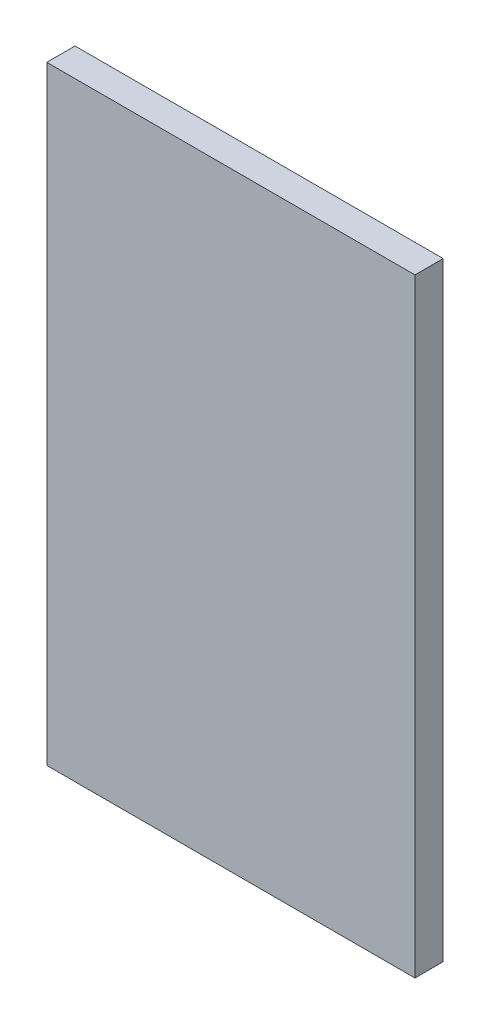
ISO-10303-21;
HEADER;
FILE_DESCRIPTION(('STEP AP214'),'2;1');
FILE_NAME('part.step','',(''),(''),'','','');
FILE_SCHEMA(('AUTOMOTIVE_DESIGN { 1 0 10303 214 1 1 1 1 }'));
ENDSEC;
DATA;
#1=APPLICATION_CONTEXT('core data for automotive mechanical design processes');
#2=APPLICATION_PROTOCOL_DEFINITION('international standard','automotive_design',2000,#1);
#3=PRODUCT_CONTEXT('',#1,'mechanical');
#4=PRODUCT('Part','Part','',(#3));
#5=PRODUCT_RELATED_PRODUCT_CATEGORY('part','',(#4));
#6=PRODUCT_DEFINITION_FORMATION('','',#4);
#7=PRODUCT_DEFINITION_CONTEXT('part definition',#1,'design');
#8=PRODUCT_DEFINITION('design','',#6,#7);
#9=PRODUCT_DEFINITION_SHAPE('','',#8);
#10=(LENGTH_UNIT() NAMED_UNIT(*) SI_UNIT(.MILLI.,.METRE.));
#11=(NAMED_UNIT(*) PLANE_ANGLE_UNIT() SI_UNIT($,.RADIAN.));
#12=(NAMED_UNIT(*) SI_UNIT($,.STERADIAN.) SOLID_ANGLE_UNIT());
#13=UNCERTAINTY_MEASURE_WITH_UNIT(LENGTH_MEASURE(1.E-05),#10,'distance_accuracy_value','');
#14=(GEOMETRIC_REPRESENTATION_CONTEXT(3) GLOBAL_UNCERTAINTY_ASSIGNED_CONTEXT((#13)) GLOBAL_UNIT_ASSIGNED_CONTEXT((#10,
#11,#12)) REPRESENTATION_CONTEXT('',''));
#15=CARTESIAN_POINT('',(0.,0.,0.));
#16=DIRECTION('',(0.,0.,1.));
#17=DIRECTION('',(1.,0.,0.));
#18=AXIS2_PLACEMENT_3D('',#15,#16,#17);
#19=CARTESIAN_POINT('',(-32.7272727272732,70.5301378498123,5.));
#20=DIRECTION('',(1.,0.,0.));
#21=DIRECTION('',(0.,1.,0.));
#22=AXIS2_PLACEMENT_3D('',#19,#20,#21);
#23=PLANE('',#22);
#24=DIRECTION('',(0.,-1.,0.));
#25=VECTOR('',#24,1.);
#26=CARTESIAN_POINT('',(-32.7272727272732,70.5301378498123,0.));
#27=LINE('',#26,#25);
#28=CARTESIAN_POINT('',(-32.7272727272732,70.5301378498123,0.));
#29=VERTEX_POINT('',#28);
#30=CARTESIAN_POINT('',(-32.7272727272732,-37.2054486570854,0.));
#31=VERTEX_POINT('',#30);
#32=EDGE_CURVE('E99',#29,#31,#27,.T.);
#33=ORIENTED_EDGE('',*,*,#32,.T.);
#34=DIRECTION('',(0.,0.,-1.));
#35=VECTOR('',#34,1.);
#36=CARTESIAN_POINT('',(-32.7272727272732,-37.2054486570854,5.));
#37=LINE('',#36,#35);
#38=CARTESIAN_POINT('',(-32.7272727272732,-37.2054486570854,5.));
#39=VERTEX_POINT('',#38);
#40=EDGE_CURVE('E11',#39,#31,#37,.T.);
#41=ORIENTED_EDGE('',*,*,#40,.F.);
#42=DIRECTION('',(0.,-1.,0.));
#43=VECTOR('',#42,1.);
#44=CARTESIAN_POINT('',(-32.7272727272732,70.5301378498123,5.));
#45=LINE('',#44,#43);
#46=CARTESIAN_POINT('',(-32.7272727272732,70.5301378498123,5.));
#47=VERTEX_POINT('',#46);
#48=EDGE_CURVE('E87',#47,#39,#45,.T.);
#49=ORIENTED_EDGE('',*,*,#48,.F.);
#50=DIRECTION('',(0.,0.,-1.));
#51=VECTOR('',#50,1.);
#52=CARTESIAN_POINT('',(-32.7272727272732,70.5301378498123,5.));
#53=LINE('',#52,#51);
#54=EDGE_CURVE('E95',#47,#29,#53,.T.);
#55=ORIENTED_EDGE('',*,*,#54,.T.);
#56=EDGE_LOOP('',(#33,#41,#49,#55));
#57=FACE_BOUND('',#56,.T.);
#58=ADVANCED_FACE('F36',(#57),#23,.F.);
#59=CARTESIAN_POINT('',(-32.7272727272732,-37.2054486570854,5.));
#60=DIRECTION('',(0.,1.,0.));
#61=DIRECTION('',(-1.,0.,0.));
#62=AXIS2_PLACEMENT_3D('',#59,#60,#61);
#63=PLANE('',#62);
#64=DIRECTION('',(1.,0.,0.));
#65=VECTOR('',#64,1.);
#66=CARTESIAN_POINT('',(-32.7272727272732,-37.2054486570854,0.));
#67=LINE('',#66,#65);
#68=CARTESIAN_POINT('',(32.4145782517298,-37.2054486570854,0.));
#69=VERTEX_POINT('',#68);
#70=EDGE_CURVE('E91',#31,#69,#67,.T.);
#71=ORIENTED_EDGE('',*,*,#70,.T.);
#72=DIRECTION('',(0.,0.,-1.));
#73=VECTOR('',#72,1.);
#74=CARTESIAN_POINT('',(32.4145782517298,-37.2054486570854,5.));
#75=LINE('',#74,#73);
#76=CARTESIAN_POINT('',(32.4145782517298,-37.2054486570854,5.));
#77=VERTEX_POINT('',#76);
#78=EDGE_CURVE('E44',#77,#69,#75,.T.);
#79=ORIENTED_EDGE('',*,*,#78,.F.);
#80=DIRECTION('',(1.,0.,0.));
#81=VECTOR('',#80,1.);
#82=CARTESIAN_POINT('',(-32.7272727272732,-37.2054486570854,5.));
#83=LINE('',#82,#81);
#84=EDGE_CURVE('E82',#39,#77,#83,.T.);
#85=ORIENTED_EDGE('',*,*,#84,.F.);
#86=ORIENTED_EDGE('',*,*,#40,.T.);
#87=EDGE_LOOP('',(#71,#79,#85,#86));
#88=FACE_BOUND('',#87,.T.);
#89=ADVANCED_FACE('F90',(#88),#63,.F.);
#90=CARTESIAN_POINT('',(32.4145782517298,70.5301378498123,5.));
#91=DIRECTION('',(-1.,0.,0.));
#92=DIRECTION('',(0.,-1.,0.));
#93=AXIS2_PLACEMENT_3D('',#90,#91,#92);
#94=PLANE('',#93);
#95=DIRECTION('',(0.,1.,0.));
#96=VECTOR('',#95,1.);
#97=CARTESIAN_POINT('',(32.4145782517298,70.5301378498123,0.));
#98=LINE('',#97,#96);
#99=CARTESIAN_POINT('',(32.4145782517298,70.5301378498123,0.));
#100=VERTEX_POINT('',#99);
#101=EDGE_CURVE('E69',#69,#100,#98,.T.);
#102=ORIENTED_EDGE('',*,*,#101,.T.);
#103=DIRECTION('',(0.,0.,-1.));
#104=VECTOR('',#103,1.);
#105=CARTESIAN_POINT('',(32.4145782517298,70.5301378498123,5.));
#106=LINE('',#105,#104);
#107=CARTESIAN_POINT('',(32.4145782517298,70.5301378498123,5.));
#108=VERTEX_POINT('',#107);
#109=EDGE_CURVE('E92',#108,#100,#106,.T.);
#110=ORIENTED_EDGE('',*,*,#109,.F.);
#111=DIRECTION('',(0.,1.,0.));
#112=VECTOR('',#111,1.);
#113=CARTESIAN_POINT('',(32.4145782517298,70.5301378498123,5.));
#114=LINE('',#113,#112);
#115=EDGE_CURVE('E85',#77,#108,#114,.T.);
#116=ORIENTED_EDGE('',*,*,#115,.F.);
#117=ORIENTED_EDGE('',*,*,#78,.T.);
#118=EDGE_LOOP('',(#102,#110,#116,#117));
#119=FACE_BOUND('',#118,.T.);
#120=ADVANCED_FACE('F93',(#119),#94,.F.);
#121=CARTESIAN_POINT('',(-32.7272727272732,70.5301378498123,5.));
#122=DIRECTION('',(0.,-1.,0.));
#123=DIRECTION('',(1.,0.,0.));
#124=AXIS2_PLACEMENT_3D('',#121,#122,#123);
#125=PLANE('',#124);
#126=DIRECTION('',(-1.,0.,0.));
#127=VECTOR('',#126,1.);
#128=CARTESIAN_POINT('',(-32.7272727272732,70.5301378498123,0.));
#129=LINE('',#128,#127);
#130=EDGE_CURVE('E75',#100,#29,#129,.T.);
#131=ORIENTED_EDGE('',*,*,#130,.T.);
#132=ORIENTED_EDGE('',*,*,#54,.F.);
#133=DIRECTION('',(-1.,0.,0.));
#134=VECTOR('',#133,1.);
#135=CARTESIAN_POINT('',(-32.7272727272732,70.5301378498123,5.));
#136=LINE('',#135,#134);
#137=EDGE_CURVE('E52',#108,#47,#136,.T.);
#138=ORIENTED_EDGE('',*,*,#137,.F.);
#139=ORIENTED_EDGE('',*,*,#109,.T.);
#140=EDGE_LOOP('',(#131,#132,#138,#139));
#141=FACE_BOUND('',#140,.T.);
#142=ADVANCED_FACE('F106',(#141),#125,.F.);
#143=CARTESIAN_POINT('',(0.,0.,5.));
#144=DIRECTION('',(0.,0.,1.));
#145=DIRECTION('',(1.,0.,0.));
#146=AXIS2_PLACEMENT_3D('',#143,#144,#145);
#147=PLANE('',#146);
#148=ORIENTED_EDGE('',*,*,#48,.T.);
#149=ORIENTED_EDGE('',*,*,#84,.T.);
#150=ORIENTED_EDGE('',*,*,#115,.T.);
#151=ORIENTED_EDGE('',*,*,#137,.T.);
#152=EDGE_LOOP('',(#148,#149,#150,#151));
#153=FACE_BOUND('',#152,.T.);
#154=ADVANCED_FACE('F83',(#153),#147,.T.);
#155=CARTESIAN_POINT('',(0.,0.,0.));
#156=DIRECTION('',(0.,0.,1.));
#157=DIRECTION('',(1.,0.,0.));
#158=AXIS2_PLACEMENT_3D('',#155,#156,#157);
#159=PLANE('',#158);
#160=ORIENTED_EDGE('',*,*,#32,.F.);
#161=ORIENTED_EDGE('',*,*,#130,.F.);
#162=ORIENTED_EDGE('',*,*,#101,.F.);
#163=ORIENTED_EDGE('',*,*,#70,.F.);
#164=EDGE_LOOP('',(#160,#161,#162,#163));
#165=FACE_BOUND('',#164,.T.);
#166=ADVANCED_FACE('F109',(#165),#159,.F.);
#167=CLOSED_SHELL('',(#58,#89,#120,#142,#154,#166));
#168=MANIFOLD_SOLID_BREP('B2',#167);
#169=ADVANCED_BREP_SHAPE_REPRESENTATION('',(#18,#168),#14);
#170=SHAPE_DEFINITION_REPRESENTATION(#9,#169);
ENDSEC;
END-ISO-10303-21;
